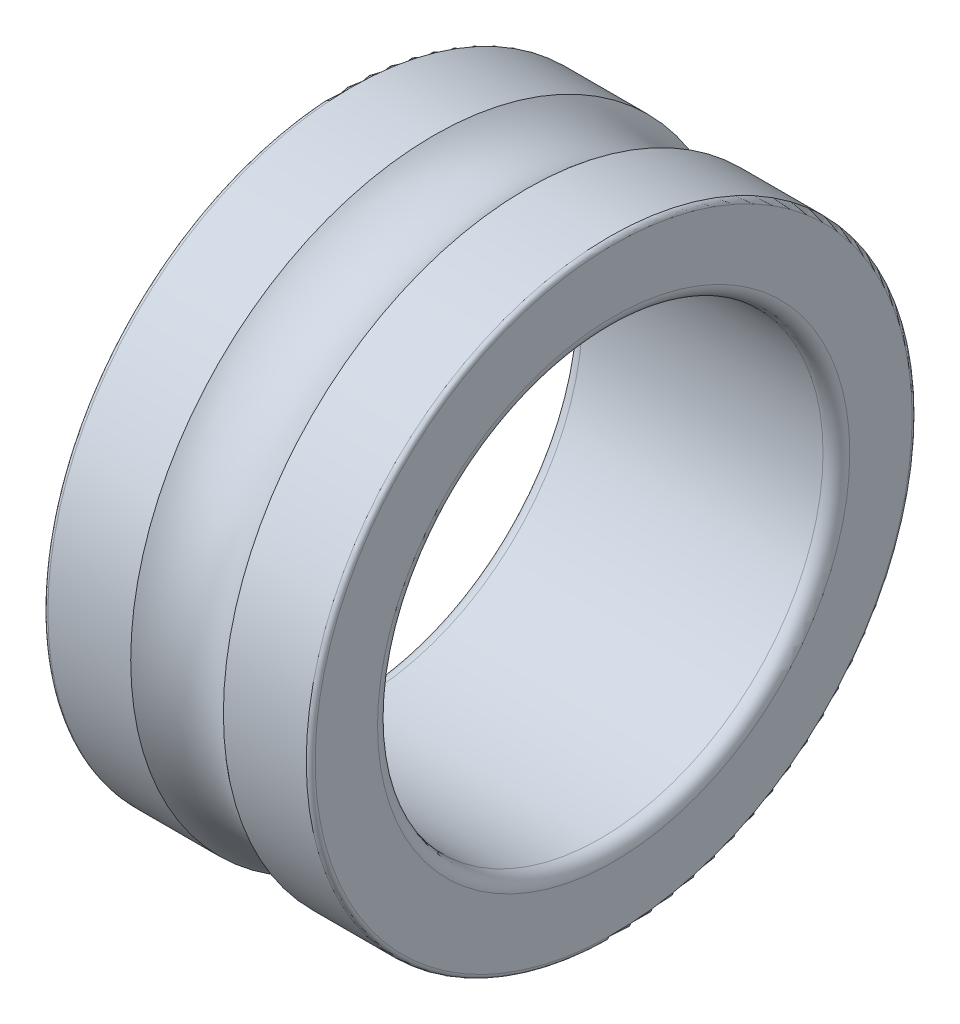
ISO-10303-21;
HEADER;
FILE_DESCRIPTION(('STEP AP214'),'2;1');
FILE_NAME('part.step','',(''),(''),'','','');
FILE_SCHEMA(('AUTOMOTIVE_DESIGN { 1 0 10303 214 1 1 1 1 }'));
ENDSEC;
DATA;
#1=APPLICATION_CONTEXT('core data for automotive mechanical design processes');
#2=APPLICATION_PROTOCOL_DEFINITION('international standard','automotive_design',2000,#1);
#3=PRODUCT_CONTEXT('',#1,'mechanical');
#4=PRODUCT('Part','Part','',(#3));
#5=PRODUCT_RELATED_PRODUCT_CATEGORY('part','',(#4));
#6=PRODUCT_DEFINITION_FORMATION('','',#4);
#7=PRODUCT_DEFINITION_CONTEXT('part definition',#1,'design');
#8=PRODUCT_DEFINITION('design','',#6,#7);
#9=PRODUCT_DEFINITION_SHAPE('','',#8);
#10=(LENGTH_UNIT() NAMED_UNIT(*) SI_UNIT(.MILLI.,.METRE.));
#11=(NAMED_UNIT(*) PLANE_ANGLE_UNIT() SI_UNIT($,.RADIAN.));
#12=(NAMED_UNIT(*) SI_UNIT($,.STERADIAN.) SOLID_ANGLE_UNIT());
#13=UNCERTAINTY_MEASURE_WITH_UNIT(LENGTH_MEASURE(1.E-05),#10,'distance_accuracy_value','');
#14=(GEOMETRIC_REPRESENTATION_CONTEXT(3) GLOBAL_UNCERTAINTY_ASSIGNED_CONTEXT((#13)) GLOBAL_UNIT_ASSIGNED_CONTEXT((#10,
#11,#12)) REPRESENTATION_CONTEXT('',''));
#15=CARTESIAN_POINT('',(0.,0.,0.));
#16=DIRECTION('',(0.,0.,1.));
#17=DIRECTION('',(1.,0.,0.));
#18=AXIS2_PLACEMENT_3D('',#15,#16,#17);
#19=CARTESIAN_POINT('',(1.35,0.,0.));
#20=DIRECTION('',(-1.,0.,0.));
#21=DIRECTION('',(0.,0.,1.));
#22=AXIS2_PLACEMENT_3D('',#19,#20,#21);
#23=CYLINDRICAL_SURFACE('',#22,2.5);
#24=CARTESIAN_POINT('',(-1.35,0.,0.));
#25=DIRECTION('',(1.,0.,0.));
#26=DIRECTION('',(0.,0.,-1.));
#27=AXIS2_PLACEMENT_3D('',#24,#25,#26);
#28=CIRCLE('',#27,2.5);
#29=CARTESIAN_POINT('',(-1.35,0.,-2.5));
#30=VERTEX_POINT('',#29);
#31=EDGE_CURVE('E112',#30,#30,#28,.T.);
#32=ORIENTED_EDGE('',*,*,#31,.F.);
#33=EDGE_LOOP('',(#32));
#34=FACE_BOUND('',#33,.T.);
#35=CARTESIAN_POINT('',(1.35,0.,0.));
#36=DIRECTION('',(1.,0.,0.));
#37=DIRECTION('',(0.,0.,-1.));
#38=AXIS2_PLACEMENT_3D('',#35,#36,#37);
#39=CIRCLE('',#38,2.5);
#40=CARTESIAN_POINT('',(1.35,0.,-2.5));
#41=VERTEX_POINT('',#40);
#42=EDGE_CURVE('E116',#41,#41,#39,.F.);
#43=ORIENTED_EDGE('',*,*,#42,.F.);
#44=EDGE_LOOP('',(#43));
#45=FACE_BOUND('',#44,.T.);
#46=ADVANCED_FACE('F14',(#34,#45),#23,.F.);
#47=CARTESIAN_POINT('',(1.35,0.,0.));
#48=DIRECTION('',(1.,0.,0.));
#49=DIRECTION('',(0.,0.,-1.));
#50=AXIS2_PLACEMENT_3D('',#47,#48,#49);
#51=TOROIDAL_SURFACE('',#50,2.65,0.150000000000001);
#52=ORIENTED_EDGE('',*,*,#42,.T.);
#53=EDGE_LOOP('',(#52));
#54=FACE_BOUND('',#53,.T.);
#55=CARTESIAN_POINT('',(1.5,0.,0.));
#56=DIRECTION('',(1.,0.,0.));
#57=DIRECTION('',(0.,0.,-1.));
#58=AXIS2_PLACEMENT_3D('',#55,#56,#57);
#59=CIRCLE('',#58,2.65);
#60=CARTESIAN_POINT('',(1.5,0.,-2.65));
#61=VERTEX_POINT('',#60);
#62=EDGE_CURVE('E115',#61,#61,#59,.F.);
#63=ORIENTED_EDGE('',*,*,#62,.F.);
#64=EDGE_LOOP('',(#63));
#65=FACE_BOUND('',#64,.T.);
#66=ADVANCED_FACE('F132',(#54,#65),#51,.T.);
#67=CARTESIAN_POINT('',(-1.35,0.,0.));
#68=DIRECTION('',(1.,0.,0.));
#69=DIRECTION('',(0.,0.,-1.));
#70=AXIS2_PLACEMENT_3D('',#67,#68,#69);
#71=TOROIDAL_SURFACE('',#70,2.65,0.150000000000001);
#72=CARTESIAN_POINT('',(-1.5,0.,0.));
#73=DIRECTION('',(-1.,0.,0.));
#74=DIRECTION('',(0.,0.,-1.));
#75=AXIS2_PLACEMENT_3D('',#72,#73,#74);
#76=CIRCLE('',#75,2.65);
#77=CARTESIAN_POINT('',(-1.5,0.,-2.65));
#78=VERTEX_POINT('',#77);
#79=EDGE_CURVE('E121',#78,#78,#76,.F.);
#80=ORIENTED_EDGE('',*,*,#79,.F.);
#81=EDGE_LOOP('',(#80));
#82=FACE_BOUND('',#81,.T.);
#83=ORIENTED_EDGE('',*,*,#31,.T.);
#84=EDGE_LOOP('',(#83));
#85=FACE_BOUND('',#84,.T.);
#86=ADVANCED_FACE('F87',(#82,#85),#71,.T.);
#87=CARTESIAN_POINT('',(1.5,2.65,0.));
#88=DIRECTION('',(1.,0.,0.));
#89=DIRECTION('',(0.,0.,-1.));
#90=AXIS2_PLACEMENT_3D('',#87,#88,#89);
#91=PLANE('',#90);
#92=ORIENTED_EDGE('',*,*,#62,.T.);
#93=EDGE_LOOP('',(#92));
#94=FACE_BOUND('',#93,.T.);
#95=CARTESIAN_POINT('',(1.5,0.,0.));
#96=DIRECTION('',(-1.,0.,0.));
#97=DIRECTION('',(0.,0.,-1.));
#98=AXIS2_PLACEMENT_3D('',#95,#96,#97);
#99=CIRCLE('',#98,3.35);
#100=CARTESIAN_POINT('',(1.5,0.,-3.35));
#101=VERTEX_POINT('',#100);
#102=EDGE_CURVE('E70',#101,#101,#99,.T.);
#103=ORIENTED_EDGE('',*,*,#102,.F.);
#104=EDGE_LOOP('',(#103));
#105=FACE_BOUND('',#104,.T.);
#106=ADVANCED_FACE('F77',(#94,#105),#91,.T.);
#107=CARTESIAN_POINT('',(-1.5,3.35,0.));
#108=DIRECTION('',(-1.,0.,0.));
#109=DIRECTION('',(0.,0.,1.));
#110=AXIS2_PLACEMENT_3D('',#107,#108,#109);
#111=PLANE('',#110);
#112=CARTESIAN_POINT('',(-1.5,0.,0.));
#113=DIRECTION('',(1.,0.,0.));
#114=DIRECTION('',(0.,0.,-1.));
#115=AXIS2_PLACEMENT_3D('',#112,#113,#114);
#116=CIRCLE('',#115,3.35);
#117=CARTESIAN_POINT('',(-1.5,0.,-3.35));
#118=VERTEX_POINT('',#117);
#119=EDGE_CURVE('E37',#118,#118,#116,.T.);
#120=ORIENTED_EDGE('',*,*,#119,.F.);
#121=EDGE_LOOP('',(#120));
#122=FACE_BOUND('',#121,.T.);
#123=ORIENTED_EDGE('',*,*,#79,.T.);
#124=EDGE_LOOP('',(#123));
#125=FACE_BOUND('',#124,.T.);
#126=ADVANCED_FACE('F86',(#122,#125),#111,.T.);
#127=CARTESIAN_POINT('',(1.45,0.,0.));
#128=DIRECTION('',(1.,0.,0.));
#129=DIRECTION('',(0.,0.,-1.));
#130=AXIS2_PLACEMENT_3D('',#127,#128,#129);
#131=TOROIDAL_SURFACE('',#130,3.35,0.0499999999999997);
#132=ORIENTED_EDGE('',*,*,#102,.T.);
#133=EDGE_LOOP('',(#132));
#134=FACE_BOUND('',#133,.T.);
#135=CARTESIAN_POINT('',(1.45,0.,0.));
#136=DIRECTION('',(-1.,0.,0.));
#137=DIRECTION('',(0.,0.,1.));
#138=AXIS2_PLACEMENT_3D('',#135,#136,#137);
#139=CIRCLE('',#138,3.4);
#140=CARTESIAN_POINT('',(1.45,0.,3.4));
#141=VERTEX_POINT('',#140);
#142=EDGE_CURVE('E34',#141,#141,#139,.T.);
#143=ORIENTED_EDGE('',*,*,#142,.F.);
#144=EDGE_LOOP('',(#143));
#145=FACE_BOUND('',#144,.T.);
#146=ADVANCED_FACE('F49',(#134,#145),#131,.T.);
#147=CARTESIAN_POINT('',(-1.45,0.,0.));
#148=DIRECTION('',(1.,0.,0.));
#149=DIRECTION('',(0.,0.,-1.));
#150=AXIS2_PLACEMENT_3D('',#147,#148,#149);
#151=TOROIDAL_SURFACE('',#150,3.35,0.0499999999999997);
#152=CARTESIAN_POINT('',(-1.45,0.,0.));
#153=DIRECTION('',(-1.,0.,0.));
#154=DIRECTION('',(0.,0.,1.));
#155=AXIS2_PLACEMENT_3D('',#152,#153,#154);
#156=CIRCLE('',#155,3.4);
#157=CARTESIAN_POINT('',(-1.45,0.,3.4));
#158=VERTEX_POINT('',#157);
#159=EDGE_CURVE('E27',#158,#158,#156,.F.);
#160=ORIENTED_EDGE('',*,*,#159,.F.);
#161=EDGE_LOOP('',(#160));
#162=FACE_BOUND('',#161,.T.);
#163=ORIENTED_EDGE('',*,*,#119,.T.);
#164=EDGE_LOOP('',(#163));
#165=FACE_BOUND('',#164,.T.);
#166=ADVANCED_FACE('F43',(#162,#165),#151,.T.);
#167=CARTESIAN_POINT('',(1.35,0.,0.));
#168=DIRECTION('',(-1.,0.,0.));
#169=DIRECTION('',(0.,0.,1.));
#170=AXIS2_PLACEMENT_3D('',#167,#168,#169);
#171=CYLINDRICAL_SURFACE('',#170,3.4);
#172=CARTESIAN_POINT('',(0.520034614232553,0.,0.));
#173=DIRECTION('',(1.,0.,0.));
#174=DIRECTION('',(0.,0.,-1.));
#175=AXIS2_PLACEMENT_3D('',#172,#173,#174);
#176=CIRCLE('',#175,3.4);
#177=CARTESIAN_POINT('',(0.520034614232553,0.,-3.4));
#178=VERTEX_POINT('',#177);
#179=EDGE_CURVE('E22',#178,#178,#176,.T.);
#180=ORIENTED_EDGE('',*,*,#179,.T.);
#181=EDGE_LOOP('',(#180));
#182=FACE_BOUND('',#181,.T.);
#183=ORIENTED_EDGE('',*,*,#142,.T.);
#184=EDGE_LOOP('',(#183));
#185=FACE_BOUND('',#184,.T.);
#186=ADVANCED_FACE('F48',(#182,#185),#171,.T.);
#187=CARTESIAN_POINT('',(1.35,0.,0.));
#188=DIRECTION('',(-1.,0.,0.));
#189=DIRECTION('',(0.,0.,1.));
#190=AXIS2_PLACEMENT_3D('',#187,#188,#189);
#191=CYLINDRICAL_SURFACE('',#190,3.4);
#192=ORIENTED_EDGE('',*,*,#159,.T.);
#193=EDGE_LOOP('',(#192));
#194=FACE_BOUND('',#193,.T.);
#195=CARTESIAN_POINT('',(-0.520034614232553,0.,0.));
#196=DIRECTION('',(1.,0.,0.));
#197=DIRECTION('',(0.,0.,-1.));
#198=AXIS2_PLACEMENT_3D('',#195,#196,#197);
#199=CIRCLE('',#198,3.4);
#200=CARTESIAN_POINT('',(-0.520034614232553,0.,-3.4));
#201=VERTEX_POINT('',#200);
#202=EDGE_CURVE('E10',#201,#201,#199,.F.);
#203=ORIENTED_EDGE('',*,*,#202,.T.);
#204=EDGE_LOOP('',(#203));
#205=FACE_BOUND('',#204,.T.);
#206=ADVANCED_FACE('F146',(#194,#205),#191,.T.);
#207=CARTESIAN_POINT('',(0.,0.,0.));
#208=DIRECTION('',(1.,0.,0.));
#209=DIRECTION('',(0.,0.,-1.));
#210=AXIS2_PLACEMENT_3D('',#207,#208,#209);
#211=TOROIDAL_SURFACE('',#210,4.,0.794000000000001);
#212=ORIENTED_EDGE('',*,*,#202,.F.);
#213=EDGE_LOOP('',(#212));
#214=FACE_BOUND('',#213,.T.);
#215=ORIENTED_EDGE('',*,*,#179,.F.);
#216=EDGE_LOOP('',(#215));
#217=FACE_BOUND('',#216,.T.);
#218=ADVANCED_FACE('F144',(#214,#217),#211,.F.);
#219=CLOSED_SHELL('',(#46,#66,#86,#106,#126,#146,#166,#186,#206,#218));
#220=MANIFOLD_SOLID_BREP('B1',#219);
#221=ADVANCED_BREP_SHAPE_REPRESENTATION('',(#18,#220),#14);
#222=SHAPE_DEFINITION_REPRESENTATION(#9,#221);
ENDSEC;
END-ISO-10303-21;
